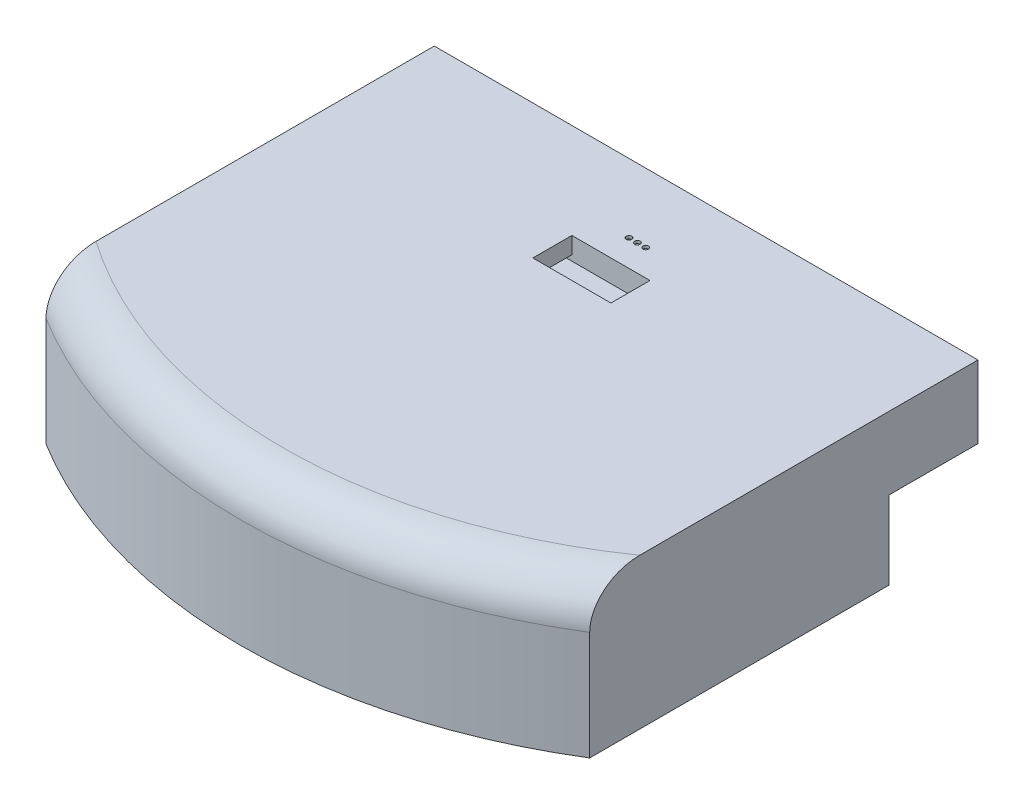
ISO-10303-21;
HEADER;
FILE_DESCRIPTION(('STEP AP214'),'2;1');
FILE_NAME('part.step','',(''),(''),'','','');
FILE_SCHEMA(('AUTOMOTIVE_DESIGN { 1 0 10303 214 1 1 1 1 }'));
ENDSEC;
DATA;
#1=APPLICATION_CONTEXT('core data for automotive mechanical design processes');
#2=APPLICATION_PROTOCOL_DEFINITION('international standard','automotive_design',2000,#1);
#3=PRODUCT_CONTEXT('',#1,'mechanical');
#4=PRODUCT('Part','Part','',(#3));
#5=PRODUCT_RELATED_PRODUCT_CATEGORY('part','',(#4));
#6=PRODUCT_DEFINITION_FORMATION('','',#4);
#7=PRODUCT_DEFINITION_CONTEXT('part definition',#1,'design');
#8=PRODUCT_DEFINITION('design','',#6,#7);
#9=PRODUCT_DEFINITION_SHAPE('','',#8);
#10=(LENGTH_UNIT() NAMED_UNIT(*) SI_UNIT(.MILLI.,.METRE.));
#11=(NAMED_UNIT(*) PLANE_ANGLE_UNIT() SI_UNIT($,.RADIAN.));
#12=(NAMED_UNIT(*) SI_UNIT($,.STERADIAN.) SOLID_ANGLE_UNIT());
#13=UNCERTAINTY_MEASURE_WITH_UNIT(LENGTH_MEASURE(1.E-05),#10,'distance_accuracy_value','');
#14=(GEOMETRIC_REPRESENTATION_CONTEXT(3) GLOBAL_UNCERTAINTY_ASSIGNED_CONTEXT((#13)) GLOBAL_UNIT_ASSIGNED_CONTEXT((#10,
#11,#12)) REPRESENTATION_CONTEXT('',''));
#15=CARTESIAN_POINT('',(0.,0.,0.));
#16=DIRECTION('',(0.,0.,1.));
#17=DIRECTION('',(1.,0.,0.));
#18=AXIS2_PLACEMENT_3D('',#15,#16,#17);
#19=CARTESIAN_POINT('',(14.,46.,66.9255496510706));
#20=DIRECTION('',(1.,0.,0.));
#21=DIRECTION('',(0.,0.,-1.));
#22=AXIS2_PLACEMENT_3D('',#19,#20,#21);
#23=PLANE('',#22);
#24=DIRECTION('',(0.,0.,-1.));
#25=VECTOR('',#24,1.);
#26=CARTESIAN_POINT('',(14.,48.,66.9255496510706));
#27=LINE('',#26,#25);
#28=CARTESIAN_POINT('',(14.,48.,66.9255496510706));
#29=VERTEX_POINT('',#28);
#30=CARTESIAN_POINT('',(14.,48.,52.9255496510706));
#31=VERTEX_POINT('',#30);
#32=EDGE_CURVE('E246',#29,#31,#27,.T.);
#33=ORIENTED_EDGE('',*,*,#32,.F.);
#34=DIRECTION('',(0.,1.,0.));
#35=VECTOR('',#34,1.);
#36=CARTESIAN_POINT('',(14.,46.,66.9255496510706));
#37=LINE('',#36,#35);
#38=CARTESIAN_POINT('',(14.,54.,66.9255496510706));
#39=VERTEX_POINT('',#38);
#40=EDGE_CURVE('E267',#29,#39,#37,.T.);
#41=ORIENTED_EDGE('',*,*,#40,.T.);
#42=DIRECTION('',(0.,0.,-1.));
#43=VECTOR('',#42,1.);
#44=CARTESIAN_POINT('',(14.,54.,66.9255496510706));
#45=LINE('',#44,#43);
#46=CARTESIAN_POINT('',(14.,54.,52.9255496510706));
#47=VERTEX_POINT('',#46);
#48=EDGE_CURVE('E249',#39,#47,#45,.T.);
#49=ORIENTED_EDGE('',*,*,#48,.T.);
#50=DIRECTION('',(0.,1.,0.));
#51=VECTOR('',#50,1.);
#52=CARTESIAN_POINT('',(14.,46.,52.9255496510706));
#53=LINE('',#52,#51);
#54=EDGE_CURVE('E204',#31,#47,#53,.T.);
#55=ORIENTED_EDGE('',*,*,#54,.F.);
#56=EDGE_LOOP('',(#33,#41,#49,#55));
#57=FACE_BOUND('',#56,.T.);
#58=ADVANCED_FACE('F47',(#57),#23,.F.);
#59=CARTESIAN_POINT('',(-14.,46.,66.9255496510706));
#60=DIRECTION('',(-1.,0.,0.));
#61=DIRECTION('',(0.,0.,1.));
#62=AXIS2_PLACEMENT_3D('',#59,#60,#61);
#63=PLANE('',#62);
#64=DIRECTION('',(0.,0.,1.));
#65=VECTOR('',#64,1.);
#66=CARTESIAN_POINT('',(-14.,48.,66.9255496510706));
#67=LINE('',#66,#65);
#68=CARTESIAN_POINT('',(-14.,48.,52.9255496510706));
#69=VERTEX_POINT('',#68);
#70=CARTESIAN_POINT('',(-14.,48.,66.9255496510706));
#71=VERTEX_POINT('',#70);
#72=EDGE_CURVE('E243',#69,#71,#67,.T.);
#73=ORIENTED_EDGE('',*,*,#72,.F.);
#74=DIRECTION('',(0.,1.,0.));
#75=VECTOR('',#74,1.);
#76=CARTESIAN_POINT('',(-14.,46.,52.9255496510706));
#77=LINE('',#76,#75);
#78=CARTESIAN_POINT('',(-14.,54.,52.9255496510706));
#79=VERTEX_POINT('',#78);
#80=EDGE_CURVE('E274',#69,#79,#77,.T.);
#81=ORIENTED_EDGE('',*,*,#80,.T.);
#82=DIRECTION('',(0.,0.,1.));
#83=VECTOR('',#82,1.);
#84=CARTESIAN_POINT('',(-14.,54.,66.9255496510706));
#85=LINE('',#84,#83);
#86=CARTESIAN_POINT('',(-14.,54.,66.9255496510706));
#87=VERTEX_POINT('',#86);
#88=EDGE_CURVE('E260',#79,#87,#85,.T.);
#89=ORIENTED_EDGE('',*,*,#88,.T.);
#90=DIRECTION('',(0.,1.,0.));
#91=VECTOR('',#90,1.);
#92=CARTESIAN_POINT('',(-14.,46.,66.9255496510706));
#93=LINE('',#92,#91);
#94=EDGE_CURVE('E271',#71,#87,#93,.T.);
#95=ORIENTED_EDGE('',*,*,#94,.F.);
#96=EDGE_LOOP('',(#73,#81,#89,#95));
#97=FACE_BOUND('',#96,.T.);
#98=ADVANCED_FACE('F453',(#97),#63,.F.);
#99=CARTESIAN_POINT('',(0.,-5.5,143.24841519261));
#100=DIRECTION('',(0.,0.,1.));
#101=DIRECTION('',(1.,0.,0.));
#102=AXIS2_PLACEMENT_3D('',#99,#100,#101);
#103=PLANE('',#102);
#104=DIRECTION('',(1.,0.,0.));
#105=VECTOR('',#104,1.);
#106=CARTESIAN_POINT('',(6.90000000000001,-2.,143.24841519261));
#107=LINE('',#106,#105);
#108=CARTESIAN_POINT('',(-6.9,-2.,143.24841519261));
#109=VERTEX_POINT('',#108);
#110=CARTESIAN_POINT('',(6.90000000000001,-2.,143.24841519261));
#111=VERTEX_POINT('',#110);
#112=EDGE_CURVE('E299',#109,#111,#107,.T.);
#113=ORIENTED_EDGE('',*,*,#112,.F.);
#114=DIRECTION('',(0.,1.,0.));
#115=VECTOR('',#114,1.);
#116=CARTESIAN_POINT('',(-6.9,-5.5,143.24841519261));
#117=LINE('',#116,#115);
#118=CARTESIAN_POINT('',(-6.9,0.,143.24841519261));
#119=VERTEX_POINT('',#118);
#120=EDGE_CURVE('E355',#109,#119,#117,.T.);
#121=ORIENTED_EDGE('',*,*,#120,.T.);
#122=DIRECTION('',(1.,0.,0.));
#123=VECTOR('',#122,1.);
#124=CARTESIAN_POINT('',(0.,0.,143.24841519261));
#125=LINE('',#124,#123);
#126=CARTESIAN_POINT('',(6.90000000000001,0.,143.24841519261));
#127=VERTEX_POINT('',#126);
#128=EDGE_CURVE('E331',#119,#127,#125,.T.);
#129=ORIENTED_EDGE('',*,*,#128,.T.);
#130=DIRECTION('',(0.,1.,0.));
#131=VECTOR('',#130,1.);
#132=CARTESIAN_POINT('',(6.90000000000001,-5.5,143.24841519261));
#133=LINE('',#132,#131);
#134=EDGE_CURVE('E338',#111,#127,#133,.T.);
#135=ORIENTED_EDGE('',*,*,#134,.F.);
#136=EDGE_LOOP('',(#113,#121,#129,#135));
#137=FACE_BOUND('',#136,.T.);
#138=ADVANCED_FACE('F449',(#137),#103,.F.);
#139=CARTESIAN_POINT('',(0.,39.,0.));
#140=DIRECTION('',(0.,-1.,0.));
#141=DIRECTION('',(0.,0.,-1.));
#142=AXIS2_PLACEMENT_3D('',#139,#140,#141);
#143=TOROIDAL_SURFACE('',#142,170.688415192609,15.);
#144=CARTESIAN_POINT('',(0.,54.,0.));
#145=DIRECTION('',(0.,-1.,0.));
#146=DIRECTION('',(0.,0.,-1.));
#147=AXIS2_PLACEMENT_3D('',#144,#145,#146);
#148=CIRCLE('',#147,170.688415192609);
#149=CARTESIAN_POINT('',(-97.5,54.,140.100981727341));
#150=VERTEX_POINT('',#149);
#151=CARTESIAN_POINT('',(97.5,54.,140.100981727341));
#152=VERTEX_POINT('',#151);
#153=EDGE_CURVE('E422',#150,#152,#148,.F.);
#154=ORIENTED_EDGE('',*,*,#153,.F.);
#155=CARTESIAN_POINT('',(-97.5,39.,158.031444772054));
#156=CARTESIAN_POINT('',(-97.5,39.1879924681215,158.031446223805));
#157=CARTESIAN_POINT('',(-97.5,39.3759597927938,158.027291244968));
#158=CARTESIAN_POINT('',(-97.5,39.751521012494,158.010694447684));
#159=CARTESIAN_POINT('',(-97.5,39.9391149217343,157.998252950918));
#160=CARTESIAN_POINT('',(-97.5,40.500662506004,157.948555923432));
#161=CARTESIAN_POINT('',(-97.5,40.8735948264257,157.898927793558));
#162=CARTESIAN_POINT('',(-97.5,41.612025180334,157.76763075772));
#163=CARTESIAN_POINT('',(-97.5,41.9775485974379,157.686102954915));
#164=CARTESIAN_POINT('',(-97.5,42.7002901273807,157.492053428739));
#165=CARTESIAN_POINT('',(-97.5,43.0575078711313,157.379530330841));
#166=CARTESIAN_POINT('',(-97.5,43.7608507026004,157.125018180973));
#167=CARTESIAN_POINT('',(-97.5,44.1069867227887,156.983059271577));
#168=CARTESIAN_POINT('',(-97.5,44.7864680682248,156.671252449585));
#169=CARTESIAN_POINT('',(-97.5,45.1198124577483,156.501402501504));
#170=CARTESIAN_POINT('',(-97.5,45.7720980307479,156.135544071362));
#171=CARTESIAN_POINT('',(-97.5,46.0910291775804,155.939517725919));
#172=CARTESIAN_POINT('',(-97.5,46.7127416212091,155.523367138975));
#173=CARTESIAN_POINT('',(-97.5,47.0155224342878,155.303242176301));
#174=CARTESIAN_POINT('',(-97.5,47.6191480964551,154.828790244516));
#175=CARTESIAN_POINT('',(-97.5,47.9190582817659,154.573274887887));
#176=CARTESIAN_POINT('',(-97.5,48.4985373928006,154.040167228897));
#177=CARTESIAN_POINT('',(-97.5,48.7781057709707,153.762574332682));
#178=CARTESIAN_POINT('',(-97.5,49.3161513668587,153.187571009551));
#179=CARTESIAN_POINT('',(-97.5,49.5746241711453,152.890156459245));
#180=CARTESIAN_POINT('',(-97.5,50.0698808905563,152.27776869486));
#181=CARTESIAN_POINT('',(-97.5,50.3066621740181,151.962793357706));
#182=CARTESIAN_POINT('',(-97.5,50.7898837648696,151.272076263084));
#183=CARTESIAN_POINT('',(-97.5,51.0330094098401,150.894013361566));
#184=CARTESIAN_POINT('',(-97.5,51.490302858241,150.120776481839));
#185=CARTESIAN_POINT('',(-97.5,51.7044683842049,149.725601161108));
#186=CARTESIAN_POINT('',(-97.5,52.1038178615854,148.920821602338));
#187=CARTESIAN_POINT('',(-97.5,52.2889976367304,148.511215295477));
#188=CARTESIAN_POINT('',(-97.5,52.6305024528652,147.680016425195));
#189=CARTESIAN_POINT('',(-97.5,52.7868172804124,147.258419679791));
#190=CARTESIAN_POINT('',(-97.5,53.0935579300089,146.337116463024));
#191=CARTESIAN_POINT('',(-97.5,53.238999583138,145.835746358503));
#192=CARTESIAN_POINT('',(-97.5,53.4916311543339,144.823470046713));
#193=CARTESIAN_POINT('',(-97.5,53.5988181082987,144.312563103726));
#194=CARTESIAN_POINT('',(-97.5,53.7755053175575,143.283818170813));
#195=CARTESIAN_POINT('',(-97.5,53.8449717482113,142.765974385391));
#196=CARTESIAN_POINT('',(-97.5,53.9465680619031,141.726626109067));
#197=CARTESIAN_POINT('',(-97.5,53.9786947953048,141.205121313088));
#198=CARTESIAN_POINT('',(-97.5,54.0079807535442,140.087841426832));
#199=CARTESIAN_POINT('',(-97.5,53.9995995311413,139.491915036721));
#200=CARTESIAN_POINT('',(-97.5,53.9354343146483,138.30258578409));
#201=CARTESIAN_POINT('',(-97.5,53.8796453125308,137.709183194833));
#202=CARTESIAN_POINT('',(-97.5,53.7212203399147,136.529555524861));
#203=CARTESIAN_POINT('',(-97.5,53.6186547596804,135.943321013694));
#204=CARTESIAN_POINT('',(-97.5,53.3669424243175,134.781000568222));
#205=CARTESIAN_POINT('',(-97.5,53.2177997244401,134.204913755015));
#206=CARTESIAN_POINT('',(-97.5,53.0454814624395,133.635786886149));
#207=B_SPLINE_CURVE_WITH_KNOTS('',3,(#155,#156,#157,#158,#159,#160,#161,#162,#163,#164,#165,
#166,#167,#168,#169,#170,#171,#172,#173,#174,#175,#176,#177,#178,#179,#180,#181,#182,#183,#184,
#185,#186,#187,#188,#189,#190,#191,#192,#193,#194,#195,#196,#197,#198,#199,#200,#201,#202,#203,
#204,#205,#206),.UNSPECIFIED.,.F.,.F.,(4,2,2,2,2,2,2,2,2,2,2,2,2,2,2,2,2,2,2,2,2,2,2,2,2,4),(0.,
0.56388155257655,1.12774121666684,2.25482442288511,3.37697751294988,4.49918037444742,
5.62023971402813,6.74138090481983,7.86329113612908,8.98523495083815,10.1660304347723,
11.3468576912012,12.5279313600774,13.7091481301554,15.0562767012667,16.4035111510162,
17.7509395321961,19.098843771584,20.6633815571553,22.2280405420412,23.7941002761446,
25.3602920991853,27.146296134611,28.9324888620426,30.716002517455,32.49936093398),.UNSPECIFIED.);
#208=CARTESIAN_POINT('',(-97.5,39.,158.031444772055));
#209=VERTEX_POINT('',#208);
#210=EDGE_CURVE('E57',#209,#150,#207,.T.);
#211=ORIENTED_EDGE('',*,*,#210,.F.);
#212=CARTESIAN_POINT('',(0.,39.,0.));
#213=DIRECTION('',(0.,-1.,0.));
#214=DIRECTION('',(0.,0.,-1.));
#215=AXIS2_PLACEMENT_3D('',#212,#213,#214);
#216=CIRCLE('',#215,185.688415192609);
#217=CARTESIAN_POINT('',(97.5,39.,158.031444772055));
#218=VERTEX_POINT('',#217);
#219=EDGE_CURVE('E435',#218,#209,#216,.T.);
#220=ORIENTED_EDGE('',*,*,#219,.F.);
#221=CARTESIAN_POINT('',(97.5,54.,140.100981727341));
#222=CARTESIAN_POINT('',(97.5,53.9999978127173,140.419395035162));
#223=CARTESIAN_POINT('',(97.5,53.993169081125,140.737809575596));
#224=CARTESIAN_POINT('',(97.5,53.9657579954031,141.373950673224));
#225=CARTESIAN_POINT('',(97.5,53.9451797152616,141.691677406248));
#226=CARTESIAN_POINT('',(97.5,53.8901411535707,142.326264202521));
#227=CARTESIAN_POINT('',(97.5,53.8556667786081,142.643123056105));
#228=CARTESIAN_POINT('',(97.5,53.7727217970387,143.275080655269));
#229=CARTESIAN_POINT('',(97.5,53.7242463215606,143.590178749624));
#230=CARTESIAN_POINT('',(97.5,53.5572421683831,144.533964235539));
#231=CARTESIAN_POINT('',(97.5,53.4173114101337,145.159085986999));
#232=CARTESIAN_POINT('',(97.5,53.1641729890058,146.084701539503));
#233=CARTESIAN_POINT('',(97.5,53.0725638203939,146.391288982625));
#234=CARTESIAN_POINT('',(97.5,52.8747865714744,146.999826534385));
#235=CARTESIAN_POINT('',(97.5,52.7686153625946,147.301775630956));
#236=CARTESIAN_POINT('',(97.5,52.4781632733802,148.067466398186));
#237=CARTESIAN_POINT('',(97.5,52.283398607026,148.527283619841));
#238=CARTESIAN_POINT('',(97.5,51.8581426933434,149.429987395168));
#239=CARTESIAN_POINT('',(97.5,51.6276571918076,149.87287665749));
#240=CARTESIAN_POINT('',(97.5,51.13116809652,150.737723499342));
#241=CARTESIAN_POINT('',(97.5,50.8652074726522,151.159705568096));
#242=CARTESIAN_POINT('',(97.5,50.439845722186,151.774211217184));
#243=CARTESIAN_POINT('',(97.5,50.2936505644344,151.975973885233));
#244=CARTESIAN_POINT('',(97.5,49.9924483571192,152.372939835032));
#245=CARTESIAN_POINT('',(97.5,49.8374377622505,152.568140426773));
#246=CARTESIAN_POINT('',(97.5,49.3565744583851,153.146362893207));
#247=CARTESIAN_POINT('',(97.5,49.0173580488775,153.518422669281));
#248=CARTESIAN_POINT('',(97.5,48.3049819875282,154.228488041473));
#249=CARTESIAN_POINT('',(97.5,47.9318287165129,154.56650001419));
#250=CARTESIAN_POINT('',(97.5,47.348411493892,155.044163423255));
#251=CARTESIAN_POINT('',(97.5,47.1500223658122,155.19847143339));
#252=CARTESIAN_POINT('',(97.5,46.7456884045035,155.4967192135));
#253=CARTESIAN_POINT('',(97.5,46.5397456002359,155.640661737364));
#254=CARTESIAN_POINT('',(97.5,45.9110876384819,156.056044032669));
#255=CARTESIAN_POINT('',(97.5,45.4773770662562,156.311174891849));
#256=CARTESIAN_POINT('',(97.5,44.6515622135538,156.738428770564));
#257=CARTESIAN_POINT('',(97.5,44.2629003992993,156.917256826471));
#258=CARTESIAN_POINT('',(97.5,43.4703143643482,157.23721252696));
#259=CARTESIAN_POINT('',(97.5,43.066391520411,157.378343563116));
#260=CARTESIAN_POINT('',(97.5,42.2469777960557,157.6205788753));
#261=CARTESIAN_POINT('',(97.5,41.8314942565042,157.721707957966));
#262=CARTESIAN_POINT('',(97.5,40.9925738574797,157.882365149887));
#263=CARTESIAN_POINT('',(97.5,40.5691380492707,157.941898718731));
#264=CARTESIAN_POINT('',(97.5,39.773385397876,158.013417893851));
#265=CARTESIAN_POINT('',(97.5,39.401522772208,158.030547689708));
#266=CARTESIAN_POINT('',(97.5,38.6577512924865,158.032273049512));
#267=CARTESIAN_POINT('',(97.5,38.2858424450685,158.016871384478));
#268=CARTESIAN_POINT('',(97.5,37.5438547189082,157.953651015224));
#269=CARTESIAN_POINT('',(97.5,37.17378232104,157.905755075916));
#270=CARTESIAN_POINT('',(97.5,36.6229039483057,157.810048397197));
#271=CARTESIAN_POINT('',(97.5,36.4399508269966,157.774160570198));
#272=CARTESIAN_POINT('',(97.5,36.0757611991189,157.694548928273));
#273=CARTESIAN_POINT('',(97.5,35.8945246558472,157.65082528129));
#274=CARTESIAN_POINT('',(97.5,35.7142843869774,157.60324301996));
#275=B_SPLINE_CURVE_WITH_KNOTS('',3,(#221,#222,#223,#224,#225,#226,#227,#228,#229,#230,#231,
#232,#233,#234,#235,#236,#237,#238,#239,#240,#241,#242,#243,#244,#245,#246,#247,#248,#249,#250,
#251,#252,#253,#254,#255,#256,#257,#258,#259,#260,#261,#262,#263,#264,#265,#266,#267,#268,#269,
#270,#271,#272,#273,#274),.UNSPECIFIED.,.F.,.F.,(4,2,2,2,2,2,2,2,2,2,2,2,2,2,2,2,2,2,2,2,2,2,2,
2,2,2,4),(0.,0.95516634555786,1.91004980097456,2.86590414529,3.822091288204,5.74063781054921,
6.70029497898201,7.66015864825133,9.1566578614191,10.652916608011,12.1473791690403,
12.8946520644332,13.6422276456255,15.150382340682,16.6582540556459,17.4119664740376,
18.1654779025648,19.6718596237181,20.9535672640914,22.2351595512213,23.5159558265349,
24.7965839602507,25.9119632977848,27.0272476315288,28.1451921962078,28.704362622939,
29.2635210666734),.UNSPECIFIED.);
#276=EDGE_CURVE('E426',#152,#218,#275,.T.);
#277=ORIENTED_EDGE('',*,*,#276,.F.);
#278=EDGE_LOOP('',(#154,#211,#220,#277));
#279=FACE_BOUND('',#278,.T.);
#280=ADVANCED_FACE('F49',(#279),#143,.T.);
#281=CARTESIAN_POINT('',(0.,54.,0.));
#282=DIRECTION('',(0.,-1.,0.));
#283=DIRECTION('',(0.,0.,-1.));
#284=AXIS2_PLACEMENT_3D('',#281,#282,#283);
#285=CYLINDRICAL_SURFACE('',#284,185.688415192609);
#286=DIRECTION('',(0.,-1.,0.));
#287=VECTOR('',#286,1.);
#288=CARTESIAN_POINT('',(97.5,54.,158.031444772055));
#289=LINE('',#288,#287);
#290=CARTESIAN_POINT('',(97.5,0.,158.031444772055));
#291=VERTEX_POINT('',#290);
#292=EDGE_CURVE('E419',#218,#291,#289,.T.);
#293=ORIENTED_EDGE('',*,*,#292,.F.);
#294=ORIENTED_EDGE('',*,*,#219,.T.);
#295=DIRECTION('',(0.,-1.,0.));
#296=VECTOR('',#295,1.);
#297=CARTESIAN_POINT('',(-97.5,54.,158.031444772055));
#298=LINE('',#297,#296);
#299=CARTESIAN_POINT('',(-97.5,0.,158.031444772055));
#300=VERTEX_POINT('',#299);
#301=EDGE_CURVE('E398',#209,#300,#298,.T.);
#302=ORIENTED_EDGE('',*,*,#301,.T.);
#303=CARTESIAN_POINT('',(0.,0.,0.));
#304=DIRECTION('',(0.,1.,0.));
#305=DIRECTION('',(0.,0.,-1.));
#306=AXIS2_PLACEMENT_3D('',#303,#304,#305);
#307=CIRCLE('',#306,185.688415192609);
#308=EDGE_CURVE('E386',#300,#291,#307,.T.);
#309=ORIENTED_EDGE('',*,*,#308,.T.);
#310=EDGE_LOOP('',(#293,#294,#302,#309));
#311=FACE_BOUND('',#310,.T.);
#312=ADVANCED_FACE('F441',(#311),#285,.T.);
#313=CARTESIAN_POINT('',(97.5,54.,158.031444772055));
#314=DIRECTION('',(-1.,0.,0.));
#315=DIRECTION('',(0.,0.,1.));
#316=AXIS2_PLACEMENT_3D('',#313,#314,#315);
#317=PLANE('',#316);
#318=DIRECTION('',(0.,1.,0.));
#319=VECTOR('',#318,1.);
#320=CARTESIAN_POINT('',(97.5,54.,50.7714447720546));
#321=LINE('',#320,#319);
#322=CARTESIAN_POINT('',(97.5,0.,50.7714447720546));
#323=VERTEX_POINT('',#322);
#324=CARTESIAN_POINT('',(97.5000000000001,28.,50.7714447720546));
#325=VERTEX_POINT('',#324);
#326=EDGE_CURVE('E376',#323,#325,#321,.T.);
#327=ORIENTED_EDGE('',*,*,#326,.T.);
#328=DIRECTION('',(0.,0.,-1.));
#329=VECTOR('',#328,1.);
#330=CARTESIAN_POINT('',(97.5,28.,158.031444772055));
#331=LINE('',#330,#329);
#332=CARTESIAN_POINT('',(97.5000000000001,28.,18.7714447720545));
#333=VERTEX_POINT('',#332);
#334=EDGE_CURVE('E382',#325,#333,#331,.T.);
#335=ORIENTED_EDGE('',*,*,#334,.T.);
#336=DIRECTION('',(0.,-1.,0.));
#337=VECTOR('',#336,1.);
#338=CARTESIAN_POINT('',(97.5,54.,18.7714447720546));
#339=LINE('',#338,#337);
#340=CARTESIAN_POINT('',(97.5,54.,18.7714447720546));
#341=VERTEX_POINT('',#340);
#342=EDGE_CURVE('E415',#341,#333,#339,.T.);
#343=ORIENTED_EDGE('',*,*,#342,.F.);
#344=DIRECTION('',(0.,0.,-1.));
#345=VECTOR('',#344,1.);
#346=CARTESIAN_POINT('',(97.5,54.,158.031444772055));
#347=LINE('',#346,#345);
#348=EDGE_CURVE('E387',#152,#341,#347,.T.);
#349=ORIENTED_EDGE('',*,*,#348,.F.);
#350=ORIENTED_EDGE('',*,*,#276,.T.);
#351=ORIENTED_EDGE('',*,*,#292,.T.);
#352=DIRECTION('',(0.,0.,-1.));
#353=VECTOR('',#352,1.);
#354=CARTESIAN_POINT('',(97.5,0.,158.031444772055));
#355=LINE('',#354,#353);
#356=EDGE_CURVE('E402',#291,#323,#355,.T.);
#357=ORIENTED_EDGE('',*,*,#356,.T.);
#358=EDGE_LOOP('',(#327,#335,#343,#349,#350,#351,#357));
#359=FACE_BOUND('',#358,.T.);
#360=ADVANCED_FACE('F436',(#359),#317,.F.);
#361=CARTESIAN_POINT('',(-97.5,54.,18.7714447720546));
#362=DIRECTION('',(0.,0.,1.));
#363=DIRECTION('',(1.,0.,0.));
#364=AXIS2_PLACEMENT_3D('',#361,#362,#363);
#365=PLANE('',#364);
#366=ORIENTED_EDGE('',*,*,#342,.T.);
#367=DIRECTION('',(-1.,0.,0.));
#368=VECTOR('',#367,1.);
#369=CARTESIAN_POINT('',(347.5,28.,18.7714447720545));
#370=LINE('',#369,#368);
#371=CARTESIAN_POINT('',(-97.5,28.,18.7714447720546));
#372=VERTEX_POINT('',#371);
#373=EDGE_CURVE('E372',#333,#372,#370,.T.);
#374=ORIENTED_EDGE('',*,*,#373,.T.);
#375=DIRECTION('',(0.,-1.,0.));
#376=VECTOR('',#375,1.);
#377=CARTESIAN_POINT('',(-97.5,54.,18.7714447720546));
#378=LINE('',#377,#376);
#379=CARTESIAN_POINT('',(-97.5,54.,18.7714447720546));
#380=VERTEX_POINT('',#379);
#381=EDGE_CURVE('E411',#380,#372,#378,.T.);
#382=ORIENTED_EDGE('',*,*,#381,.F.);
#383=DIRECTION('',(-1.,0.,0.));
#384=VECTOR('',#383,1.);
#385=CARTESIAN_POINT('',(-97.5,54.,18.7714447720546));
#386=LINE('',#385,#384);
#387=EDGE_CURVE('E390',#341,#380,#386,.T.);
#388=ORIENTED_EDGE('',*,*,#387,.F.);
#389=EDGE_LOOP('',(#366,#374,#382,#388));
#390=FACE_BOUND('',#389,.T.);
#391=ADVANCED_FACE('F440',(#390),#365,.F.);
#392=CARTESIAN_POINT('',(-97.5,54.,18.7714447720546));
#393=DIRECTION('',(1.,0.,0.));
#394=DIRECTION('',(0.,0.,-1.));
#395=AXIS2_PLACEMENT_3D('',#392,#393,#394);
#396=PLANE('',#395);
#397=ORIENTED_EDGE('',*,*,#381,.T.);
#398=DIRECTION('',(0.,0.,-1.));
#399=VECTOR('',#398,1.);
#400=CARTESIAN_POINT('',(-97.5,28.,18.7714447720546));
#401=LINE('',#400,#399);
#402=CARTESIAN_POINT('',(-97.5,28.,50.7714447720546));
#403=VERTEX_POINT('',#402);
#404=EDGE_CURVE('E368',#403,#372,#401,.T.);
#405=ORIENTED_EDGE('',*,*,#404,.F.);
#406=DIRECTION('',(0.,1.,0.));
#407=VECTOR('',#406,1.);
#408=CARTESIAN_POINT('',(-97.5,0.,50.7714447720546));
#409=LINE('',#408,#407);
#410=CARTESIAN_POINT('',(-97.5,0.,50.7714447720546));
#411=VERTEX_POINT('',#410);
#412=EDGE_CURVE('E364',#411,#403,#409,.T.);
#413=ORIENTED_EDGE('',*,*,#412,.F.);
#414=DIRECTION('',(0.,0.,1.));
#415=VECTOR('',#414,1.);
#416=CARTESIAN_POINT('',(-97.5,0.,18.7714447720546));
#417=LINE('',#416,#415);
#418=EDGE_CURVE('E391',#411,#300,#417,.T.);
#419=ORIENTED_EDGE('',*,*,#418,.T.);
#420=ORIENTED_EDGE('',*,*,#301,.F.);
#421=ORIENTED_EDGE('',*,*,#210,.T.);
#422=DIRECTION('',(0.,0.,1.));
#423=VECTOR('',#422,1.);
#424=CARTESIAN_POINT('',(-97.5,54.,18.7714447720546));
#425=LINE('',#424,#423);
#426=EDGE_CURVE('E394',#380,#150,#425,.T.);
#427=ORIENTED_EDGE('',*,*,#426,.F.);
#428=EDGE_LOOP('',(#397,#405,#413,#419,#420,#421,#427));
#429=FACE_BOUND('',#428,.T.);
#430=ADVANCED_FACE('F527',(#429),#396,.F.);
#431=CARTESIAN_POINT('',(0.,54.,0.));
#432=DIRECTION('',(0.,-1.,0.));
#433=DIRECTION('',(0.,0.,-1.));
#434=AXIS2_PLACEMENT_3D('',#431,#432,#433);
#435=PLANE('',#434);
#436=DIRECTION('',(-1.,0.,0.));
#437=VECTOR('',#436,1.);
#438=CARTESIAN_POINT('',(-14.,54.,52.9255496510706));
#439=LINE('',#438,#437);
#440=EDGE_CURVE('E256',#47,#79,#439,.T.);
#441=ORIENTED_EDGE('',*,*,#440,.F.);
#442=ORIENTED_EDGE('',*,*,#48,.F.);
#443=DIRECTION('',(1.,0.,0.));
#444=VECTOR('',#443,1.);
#445=CARTESIAN_POINT('',(-14.,54.,66.9255496510706));
#446=LINE('',#445,#444);
#447=EDGE_CURVE('E251',#87,#39,#446,.T.);
#448=ORIENTED_EDGE('',*,*,#447,.F.);
#449=ORIENTED_EDGE('',*,*,#88,.F.);
#450=EDGE_LOOP('',(#441,#442,#448,#449));
#451=FACE_BOUND('',#450,.T.);
#452=CARTESIAN_POINT('',(-3.,54.,43.4388276887888));
#453=DIRECTION('',(0.,1.,0.));
#454=DIRECTION('',(0.,0.,1.));
#455=AXIS2_PLACEMENT_3D('',#452,#453,#454);
#456=CIRCLE('',#455,1.);
#457=CARTESIAN_POINT('',(-3.,54.,44.4388276887888));
#458=VERTEX_POINT('',#457);
#459=EDGE_CURVE('E288',#458,#458,#456,.T.);
#460=ORIENTED_EDGE('',*,*,#459,.F.);
#461=EDGE_LOOP('',(#460));
#462=FACE_BOUND('',#461,.T.);
#463=CARTESIAN_POINT('',(3.,54.,43.4388276887887));
#464=DIRECTION('',(0.,1.,0.));
#465=DIRECTION('',(0.,0.,1.));
#466=AXIS2_PLACEMENT_3D('',#463,#464,#465);
#467=CIRCLE('',#466,1.);
#468=CARTESIAN_POINT('',(3.,54.,44.4388276887887));
#469=VERTEX_POINT('',#468);
#470=EDGE_CURVE('E279',#469,#469,#467,.T.);
#471=ORIENTED_EDGE('',*,*,#470,.F.);
#472=EDGE_LOOP('',(#471));
#473=FACE_BOUND('',#472,.T.);
#474=CARTESIAN_POINT('',(0.,54.,43.4388276887887));
#475=DIRECTION('',(0.,1.,0.));
#476=DIRECTION('',(0.,0.,1.));
#477=AXIS2_PLACEMENT_3D('',#474,#475,#476);
#478=CIRCLE('',#477,1.);
#479=CARTESIAN_POINT('',(0.,54.,44.4388276887887));
#480=VERTEX_POINT('',#479);
#481=EDGE_CURVE('E283',#480,#480,#478,.T.);
#482=ORIENTED_EDGE('',*,*,#481,.F.);
#483=EDGE_LOOP('',(#482));
#484=FACE_BOUND('',#483,.T.);
#485=ORIENTED_EDGE('',*,*,#426,.T.);
#486=ORIENTED_EDGE('',*,*,#153,.T.);
#487=ORIENTED_EDGE('',*,*,#348,.T.);
#488=ORIENTED_EDGE('',*,*,#387,.T.);
#489=EDGE_LOOP('',(#485,#486,#487,#488));
#490=FACE_BOUND('',#489,.T.);
#491=ADVANCED_FACE('F525',(#451,#462,#473,#484,#490),#435,.F.);
#492=CARTESIAN_POINT('',(0.,0.,0.));
#493=DIRECTION('',(0.,-1.,0.));
#494=DIRECTION('',(0.,0.,-1.));
#495=AXIS2_PLACEMENT_3D('',#492,#493,#494);
#496=PLANE('',#495);
#497=DIRECTION('',(0.,0.,-1.));
#498=VECTOR('',#497,1.);
#499=CARTESIAN_POINT('',(6.90000000000002,0.,0.));
#500=LINE('',#499,#498);
#501=CARTESIAN_POINT('',(6.9,0.,159.748415192609));
#502=VERTEX_POINT('',#501);
#503=EDGE_CURVE('E326',#502,#127,#500,.T.);
#504=ORIENTED_EDGE('',*,*,#503,.T.);
#505=ORIENTED_EDGE('',*,*,#128,.F.);
#506=DIRECTION('',(0.,0.,-1.));
#507=VECTOR('',#506,1.);
#508=CARTESIAN_POINT('',(-6.89999999999998,0.,0.));
#509=LINE('',#508,#507);
#510=CARTESIAN_POINT('',(-6.9,0.,159.748415192609));
#511=VERTEX_POINT('',#510);
#512=EDGE_CURVE('E346',#511,#119,#509,.T.);
#513=ORIENTED_EDGE('',*,*,#512,.F.);
#514=DIRECTION('',(1.,0.,0.));
#515=VECTOR('',#514,1.);
#516=CARTESIAN_POINT('',(0.,0.,159.748415192609));
#517=LINE('',#516,#515);
#518=EDGE_CURVE('E342',#511,#502,#517,.T.);
#519=ORIENTED_EDGE('',*,*,#518,.T.);
#520=EDGE_LOOP('',(#504,#505,#513,#519));
#521=FACE_BOUND('',#520,.T.);
#522=DIRECTION('',(-1.,0.,0.));
#523=VECTOR('',#522,1.);
#524=CARTESIAN_POINT('',(0.,0.,50.7714447720546));
#525=LINE('',#524,#523);
#526=EDGE_CURVE('E11',#323,#411,#525,.T.);
#527=ORIENTED_EDGE('',*,*,#526,.F.);
#528=ORIENTED_EDGE('',*,*,#356,.F.);
#529=ORIENTED_EDGE('',*,*,#308,.F.);
#530=ORIENTED_EDGE('',*,*,#418,.F.);
#531=EDGE_LOOP('',(#527,#528,#529,#530));
#532=FACE_BOUND('',#531,.T.);
#533=ADVANCED_FACE('F520',(#521,#532),#496,.T.);
#534=CARTESIAN_POINT('',(347.5,28.,18.7714447720545));
#535=DIRECTION('',(0.,1.,0.));
#536=DIRECTION('',(0.,0.,1.));
#537=AXIS2_PLACEMENT_3D('',#534,#535,#536);
#538=PLANE('',#537);
#539=DIRECTION('',(-1.,0.,0.));
#540=VECTOR('',#539,1.);
#541=CARTESIAN_POINT('',(347.5,28.,50.7714447720545));
#542=LINE('',#541,#540);
#543=EDGE_CURVE('E371',#325,#403,#542,.T.);
#544=ORIENTED_EDGE('',*,*,#543,.T.);
#545=ORIENTED_EDGE('',*,*,#404,.T.);
#546=ORIENTED_EDGE('',*,*,#373,.F.);
#547=ORIENTED_EDGE('',*,*,#334,.F.);
#548=EDGE_LOOP('',(#544,#545,#546,#547));
#549=FACE_BOUND('',#548,.T.);
#550=ADVANCED_FACE('F517',(#549),#538,.F.);
#551=CARTESIAN_POINT('',(347.5,0.,50.7714447720545));
#552=DIRECTION('',(0.,0.,1.));
#553=DIRECTION('',(1.,0.,0.));
#554=AXIS2_PLACEMENT_3D('',#551,#552,#553);
#555=PLANE('',#554);
#556=ORIENTED_EDGE('',*,*,#526,.T.);
#557=ORIENTED_EDGE('',*,*,#412,.T.);
#558=ORIENTED_EDGE('',*,*,#543,.F.);
#559=ORIENTED_EDGE('',*,*,#326,.F.);
#560=EDGE_LOOP('',(#556,#557,#558,#559));
#561=FACE_BOUND('',#560,.T.);
#562=ADVANCED_FACE('F515',(#561),#555,.F.);
#563=CARTESIAN_POINT('',(6.90000000000002,-5.5,0.));
#564=DIRECTION('',(1.,0.,0.));
#565=DIRECTION('',(0.,0.,-1.));
#566=AXIS2_PLACEMENT_3D('',#563,#564,#565);
#567=PLANE('',#566);
#568=ORIENTED_EDGE('',*,*,#503,.F.);
#569=DIRECTION('',(0.,1.,0.));
#570=VECTOR('',#569,1.);
#571=CARTESIAN_POINT('',(6.9,-5.5,159.748415192609));
#572=LINE('',#571,#570);
#573=CARTESIAN_POINT('',(6.9,-5.5,159.748415192609));
#574=VERTEX_POINT('',#573);
#575=EDGE_CURVE('E361',#574,#502,#572,.T.);
#576=ORIENTED_EDGE('',*,*,#575,.F.);
#577=DIRECTION('',(0.,0.,-1.));
#578=VECTOR('',#577,1.);
#579=CARTESIAN_POINT('',(6.90000000000002,-5.5,0.));
#580=LINE('',#579,#578);
#581=CARTESIAN_POINT('',(6.90000000000001,-5.5,139.248415192609));
#582=VERTEX_POINT('',#581);
#583=EDGE_CURVE('E327',#574,#582,#580,.T.);
#584=ORIENTED_EDGE('',*,*,#583,.T.);
#585=DIRECTION('',(0.,-1.,0.));
#586=VECTOR('',#585,1.);
#587=CARTESIAN_POINT('',(6.90000000000001,-5.5,139.248415192609));
#588=LINE('',#587,#586);
#589=CARTESIAN_POINT('',(6.90000000000001,-2.,139.248415192609));
#590=VERTEX_POINT('',#589);
#591=EDGE_CURVE('E303',#590,#582,#588,.T.);
#592=ORIENTED_EDGE('',*,*,#591,.F.);
#593=DIRECTION('',(0.,0.,1.));
#594=VECTOR('',#593,1.);
#595=CARTESIAN_POINT('',(6.90000000000001,-2.,139.248415192609));
#596=LINE('',#595,#594);
#597=EDGE_CURVE('E317',#590,#111,#596,.T.);
#598=ORIENTED_EDGE('',*,*,#597,.T.);
#599=ORIENTED_EDGE('',*,*,#134,.T.);
#600=EDGE_LOOP('',(#568,#576,#584,#592,#598,#599));
#601=FACE_BOUND('',#600,.T.);
#602=ADVANCED_FACE('F511',(#601),#567,.T.);
#603=CARTESIAN_POINT('',(0.,-5.5,159.748415192609));
#604=DIRECTION('',(0.,0.,1.));
#605=DIRECTION('',(1.,0.,0.));
#606=AXIS2_PLACEMENT_3D('',#603,#604,#605);
#607=PLANE('',#606);
#608=ORIENTED_EDGE('',*,*,#518,.F.);
#609=DIRECTION('',(0.,1.,0.));
#610=VECTOR('',#609,1.);
#611=CARTESIAN_POINT('',(-6.9,-5.5,159.748415192609));
#612=LINE('',#611,#610);
#613=CARTESIAN_POINT('',(-6.9,-5.5,159.748415192609));
#614=VERTEX_POINT('',#613);
#615=EDGE_CURVE('E358',#614,#511,#612,.T.);
#616=ORIENTED_EDGE('',*,*,#615,.F.);
#617=DIRECTION('',(1.,0.,0.));
#618=VECTOR('',#617,1.);
#619=CARTESIAN_POINT('',(0.,-5.5,159.748415192609));
#620=LINE('',#619,#618);
#621=EDGE_CURVE('E330',#614,#574,#620,.T.);
#622=ORIENTED_EDGE('',*,*,#621,.T.);
#623=ORIENTED_EDGE('',*,*,#575,.T.);
#624=EDGE_LOOP('',(#608,#616,#622,#623));
#625=FACE_BOUND('',#624,.T.);
#626=ADVANCED_FACE('F507',(#625),#607,.T.);
#627=CARTESIAN_POINT('',(-6.89999999999998,-5.5,0.));
#628=DIRECTION('',(1.,0.,0.));
#629=DIRECTION('',(0.,0.,-1.));
#630=AXIS2_PLACEMENT_3D('',#627,#628,#629);
#631=PLANE('',#630);
#632=ORIENTED_EDGE('',*,*,#512,.T.);
#633=ORIENTED_EDGE('',*,*,#120,.F.);
#634=DIRECTION('',(0.,0.,1.));
#635=VECTOR('',#634,1.);
#636=CARTESIAN_POINT('',(-6.9,-2.,139.248415192609));
#637=LINE('',#636,#635);
#638=CARTESIAN_POINT('',(-6.9,-2.,139.248415192609));
#639=VERTEX_POINT('',#638);
#640=EDGE_CURVE('E323',#639,#109,#637,.T.);
#641=ORIENTED_EDGE('',*,*,#640,.F.);
#642=DIRECTION('',(0.,1.,0.));
#643=VECTOR('',#642,1.);
#644=CARTESIAN_POINT('',(-6.9,-5.5,139.248415192609));
#645=LINE('',#644,#643);
#646=CARTESIAN_POINT('',(-6.9,-5.5,139.248415192609));
#647=VERTEX_POINT('',#646);
#648=EDGE_CURVE('E311',#647,#639,#645,.T.);
#649=ORIENTED_EDGE('',*,*,#648,.F.);
#650=DIRECTION('',(0.,0.,-1.));
#651=VECTOR('',#650,1.);
#652=CARTESIAN_POINT('',(-6.89999999999998,-5.5,0.));
#653=LINE('',#652,#651);
#654=EDGE_CURVE('E335',#614,#647,#653,.T.);
#655=ORIENTED_EDGE('',*,*,#654,.F.);
#656=ORIENTED_EDGE('',*,*,#615,.T.);
#657=EDGE_LOOP('',(#632,#633,#641,#649,#655,#656));
#658=FACE_BOUND('',#657,.T.);
#659=ADVANCED_FACE('F500',(#658),#631,.F.);
#660=CARTESIAN_POINT('',(0.,-5.5,0.));
#661=DIRECTION('',(0.,-1.,0.));
#662=DIRECTION('',(0.,0.,-1.));
#663=AXIS2_PLACEMENT_3D('',#660,#661,#662);
#664=PLANE('',#663);
#665=ORIENTED_EDGE('',*,*,#583,.F.);
#666=ORIENTED_EDGE('',*,*,#621,.F.);
#667=ORIENTED_EDGE('',*,*,#654,.T.);
#668=DIRECTION('',(-1.,0.,0.));
#669=VECTOR('',#668,1.);
#670=CARTESIAN_POINT('',(6.90000000000001,-5.5,139.248415192609));
#671=LINE('',#670,#669);
#672=EDGE_CURVE('E307',#582,#647,#671,.T.);
#673=ORIENTED_EDGE('',*,*,#672,.F.);
#674=EDGE_LOOP('',(#665,#666,#667,#673));
#675=FACE_BOUND('',#674,.T.);
#676=ADVANCED_FACE('F496',(#675),#664,.T.);
#677=CARTESIAN_POINT('',(6.90000000000001,-2.,139.248415192609));
#678=DIRECTION('',(0.,-1.,0.));
#679=DIRECTION('',(0.,0.,-1.));
#680=AXIS2_PLACEMENT_3D('',#677,#678,#679);
#681=PLANE('',#680);
#682=ORIENTED_EDGE('',*,*,#112,.T.);
#683=ORIENTED_EDGE('',*,*,#597,.F.);
#684=DIRECTION('',(1.,0.,0.));
#685=VECTOR('',#684,1.);
#686=CARTESIAN_POINT('',(6.90000000000001,-2.,139.248415192609));
#687=LINE('',#686,#685);
#688=EDGE_CURVE('E314',#639,#590,#687,.T.);
#689=ORIENTED_EDGE('',*,*,#688,.F.);
#690=ORIENTED_EDGE('',*,*,#640,.T.);
#691=EDGE_LOOP('',(#682,#683,#689,#690));
#692=FACE_BOUND('',#691,.T.);
#693=ADVANCED_FACE('F492',(#692),#681,.F.);
#694=CARTESIAN_POINT('',(0.,0.,139.248415192609));
#695=DIRECTION('',(0.,0.,1.));
#696=DIRECTION('',(1.,0.,0.));
#697=AXIS2_PLACEMENT_3D('',#694,#695,#696);
#698=PLANE('',#697);
#699=ORIENTED_EDGE('',*,*,#591,.T.);
#700=ORIENTED_EDGE('',*,*,#672,.T.);
#701=ORIENTED_EDGE('',*,*,#648,.T.);
#702=ORIENTED_EDGE('',*,*,#688,.T.);
#703=EDGE_LOOP('',(#699,#700,#701,#702));
#704=FACE_BOUND('',#703,.T.);
#705=ADVANCED_FACE('F488',(#704),#698,.F.);
#706=CARTESIAN_POINT('',(0.,53.,43.4388276887887));
#707=DIRECTION('',(0.,1.,0.));
#708=DIRECTION('',(0.,0.,1.));
#709=AXIS2_PLACEMENT_3D('',#706,#707,#708);
#710=CYLINDRICAL_SURFACE('',#709,1.);
#711=CARTESIAN_POINT('',(0.,53.,43.4388276887887));
#712=DIRECTION('',(0.,1.,0.));
#713=DIRECTION('',(0.,0.,1.));
#714=AXIS2_PLACEMENT_3D('',#711,#712,#713);
#715=CIRCLE('',#714,1.);
#716=CARTESIAN_POINT('',(0.,53.,44.4388276887887));
#717=VERTEX_POINT('',#716);
#718=EDGE_CURVE('E295',#717,#717,#715,.T.);
#719=ORIENTED_EDGE('',*,*,#718,.F.);
#720=EDGE_LOOP('',(#719));
#721=FACE_BOUND('',#720,.T.);
#722=ORIENTED_EDGE('',*,*,#481,.T.);
#723=EDGE_LOOP('',(#722));
#724=FACE_BOUND('',#723,.T.);
#725=ADVANCED_FACE('F484',(#721,#724),#710,.F.);
#726=CARTESIAN_POINT('',(0.,53.,43.4388276887887));
#727=DIRECTION('',(0.,1.,0.));
#728=DIRECTION('',(0.,0.,1.));
#729=AXIS2_PLACEMENT_3D('',#726,#727,#728);
#730=PLANE('',#729);
#731=ORIENTED_EDGE('',*,*,#718,.T.);
#732=EDGE_LOOP('',(#731));
#733=FACE_BOUND('',#732,.T.);
#734=ADVANCED_FACE('F469',(#733),#730,.T.);
#735=CARTESIAN_POINT('',(3.,53.,43.4388276887887));
#736=DIRECTION('',(0.,1.,0.));
#737=DIRECTION('',(0.,0.,1.));
#738=AXIS2_PLACEMENT_3D('',#735,#736,#737);
#739=CYLINDRICAL_SURFACE('',#738,1.);
#740=CARTESIAN_POINT('',(3.,53.,43.4388276887887));
#741=DIRECTION('',(0.,1.,0.));
#742=DIRECTION('',(0.,0.,1.));
#743=AXIS2_PLACEMENT_3D('',#740,#741,#742);
#744=CIRCLE('',#743,1.);
#745=CARTESIAN_POINT('',(3.,53.,44.4388276887887));
#746=VERTEX_POINT('',#745);
#747=EDGE_CURVE('E284',#746,#746,#744,.T.);
#748=ORIENTED_EDGE('',*,*,#747,.F.);
#749=EDGE_LOOP('',(#748));
#750=FACE_BOUND('',#749,.T.);
#751=ORIENTED_EDGE('',*,*,#470,.T.);
#752=EDGE_LOOP('',(#751));
#753=FACE_BOUND('',#752,.T.);
#754=ADVANCED_FACE('F465',(#750,#753),#739,.F.);
#755=CARTESIAN_POINT('',(3.,53.,43.4388276887887));
#756=DIRECTION('',(0.,1.,0.));
#757=DIRECTION('',(0.,0.,1.));
#758=AXIS2_PLACEMENT_3D('',#755,#756,#757);
#759=PLANE('',#758);
#760=ORIENTED_EDGE('',*,*,#747,.T.);
#761=EDGE_LOOP('',(#760));
#762=FACE_BOUND('',#761,.T.);
#763=ADVANCED_FACE('F468',(#762),#759,.T.);
#764=CARTESIAN_POINT('',(-3.,53.,43.4388276887888));
#765=DIRECTION('',(0.,1.,0.));
#766=DIRECTION('',(0.,0.,1.));
#767=AXIS2_PLACEMENT_3D('',#764,#765,#766);
#768=CYLINDRICAL_SURFACE('',#767,1.);
#769=CARTESIAN_POINT('',(-3.,53.,43.4388276887888));
#770=DIRECTION('',(0.,1.,0.));
#771=DIRECTION('',(0.,0.,1.));
#772=AXIS2_PLACEMENT_3D('',#769,#770,#771);
#773=CIRCLE('',#772,1.);
#774=CARTESIAN_POINT('',(-3.,53.,44.4388276887888));
#775=VERTEX_POINT('',#774);
#776=EDGE_CURVE('E270',#775,#775,#773,.T.);
#777=ORIENTED_EDGE('',*,*,#776,.F.);
#778=EDGE_LOOP('',(#777));
#779=FACE_BOUND('',#778,.T.);
#780=ORIENTED_EDGE('',*,*,#459,.T.);
#781=EDGE_LOOP('',(#780));
#782=FACE_BOUND('',#781,.T.);
#783=ADVANCED_FACE('F473',(#779,#782),#768,.F.);
#784=CARTESIAN_POINT('',(-3.,53.,43.4388276887888));
#785=DIRECTION('',(0.,1.,0.));
#786=DIRECTION('',(0.,0.,1.));
#787=AXIS2_PLACEMENT_3D('',#784,#785,#786);
#788=PLANE('',#787);
#789=ORIENTED_EDGE('',*,*,#776,.T.);
#790=EDGE_LOOP('',(#789));
#791=FACE_BOUND('',#790,.T.);
#792=ADVANCED_FACE('F477',(#791),#788,.T.);
#793=CARTESIAN_POINT('',(-14.,46.,66.9255496510706));
#794=DIRECTION('',(0.,0.,1.));
#795=DIRECTION('',(1.,0.,0.));
#796=AXIS2_PLACEMENT_3D('',#793,#794,#795);
#797=PLANE('',#796);
#798=DIRECTION('',(1.,0.,0.));
#799=VECTOR('',#798,1.);
#800=CARTESIAN_POINT('',(-14.,46.,66.9255496510706));
#801=LINE('',#800,#799);
#802=CARTESIAN_POINT('',(-17.,46.,66.9255496510706));
#803=VERTEX_POINT('',#802);
#804=CARTESIAN_POINT('',(16.,46.,66.9255496510706));
#805=VERTEX_POINT('',#804);
#806=EDGE_CURVE('E191',#803,#805,#801,.T.);
#807=ORIENTED_EDGE('',*,*,#806,.F.);
#808=DIRECTION('',(0.,-1.,0.));
#809=VECTOR('',#808,1.);
#810=CARTESIAN_POINT('',(-17.,46.,66.9255496510706));
#811=LINE('',#810,#809);
#812=CARTESIAN_POINT('',(-17.,48.,66.9255496510706));
#813=VERTEX_POINT('',#812);
#814=EDGE_CURVE('E196',#813,#803,#811,.T.);
#815=ORIENTED_EDGE('',*,*,#814,.F.);
#816=DIRECTION('',(-1.,0.,0.));
#817=VECTOR('',#816,1.);
#818=CARTESIAN_POINT('',(16.,48.,66.9255496510706));
#819=LINE('',#818,#817);
#820=EDGE_CURVE('E236',#71,#813,#819,.T.);
#821=ORIENTED_EDGE('',*,*,#820,.F.);
#822=ORIENTED_EDGE('',*,*,#94,.T.);
#823=ORIENTED_EDGE('',*,*,#447,.T.);
#824=ORIENTED_EDGE('',*,*,#40,.F.);
#825=CARTESIAN_POINT('',(16.,48.,66.9255496510706));
#826=VERTEX_POINT('',#825);
#827=EDGE_CURVE('E64',#826,#29,#819,.T.);
#828=ORIENTED_EDGE('',*,*,#827,.F.);
#829=DIRECTION('',(0.,-1.,0.));
#830=VECTOR('',#829,1.);
#831=CARTESIAN_POINT('',(16.,46.,66.9255496510706));
#832=LINE('',#831,#830);
#833=EDGE_CURVE('E199',#826,#805,#832,.T.);
#834=ORIENTED_EDGE('',*,*,#833,.T.);
#835=EDGE_LOOP('',(#807,#815,#821,#822,#823,#824,#828,#834));
#836=FACE_BOUND('',#835,.T.);
#837=ADVANCED_FACE('F193',(#836),#797,.F.);
#838=CARTESIAN_POINT('',(-14.,46.,52.9255496510706));
#839=DIRECTION('',(0.,0.,-1.));
#840=DIRECTION('',(-1.,0.,0.));
#841=AXIS2_PLACEMENT_3D('',#838,#839,#840);
#842=PLANE('',#841);
#843=DIRECTION('',(-1.,0.,0.));
#844=VECTOR('',#843,1.);
#845=CARTESIAN_POINT('',(-14.,46.,52.9255496510706));
#846=LINE('',#845,#844);
#847=CARTESIAN_POINT('',(16.,46.,52.9255496510706));
#848=VERTEX_POINT('',#847);
#849=CARTESIAN_POINT('',(-17.,46.,52.9255496510706));
#850=VERTEX_POINT('',#849);
#851=EDGE_CURVE('E205',#848,#850,#846,.T.);
#852=ORIENTED_EDGE('',*,*,#851,.F.);
#853=DIRECTION('',(0.,1.,0.));
#854=VECTOR('',#853,1.);
#855=CARTESIAN_POINT('',(16.,46.,52.9255496510706));
#856=LINE('',#855,#854);
#857=CARTESIAN_POINT('',(16.,48.,52.9255496510706));
#858=VERTEX_POINT('',#857);
#859=EDGE_CURVE('E230',#848,#858,#856,.T.);
#860=ORIENTED_EDGE('',*,*,#859,.T.);
#861=DIRECTION('',(-1.,0.,0.));
#862=VECTOR('',#861,1.);
#863=CARTESIAN_POINT('',(16.,48.,52.9255496510706));
#864=LINE('',#863,#862);
#865=EDGE_CURVE('E239',#858,#31,#864,.T.);
#866=ORIENTED_EDGE('',*,*,#865,.T.);
#867=ORIENTED_EDGE('',*,*,#54,.T.);
#868=ORIENTED_EDGE('',*,*,#440,.T.);
#869=ORIENTED_EDGE('',*,*,#80,.F.);
#870=CARTESIAN_POINT('',(-17.,48.,52.9255496510706));
#871=VERTEX_POINT('',#870);
#872=EDGE_CURVE('E72',#69,#871,#864,.T.);
#873=ORIENTED_EDGE('',*,*,#872,.T.);
#874=DIRECTION('',(0.,1.,0.));
#875=VECTOR('',#874,1.);
#876=CARTESIAN_POINT('',(-17.,46.,52.9255496510706));
#877=LINE('',#876,#875);
#878=EDGE_CURVE('E214',#850,#871,#877,.T.);
#879=ORIENTED_EDGE('',*,*,#878,.F.);
#880=EDGE_LOOP('',(#852,#860,#866,#867,#868,#869,#873,#879));
#881=FACE_BOUND('',#880,.T.);
#882=ADVANCED_FACE('F464',(#881),#842,.F.);
#883=CARTESIAN_POINT('',(0.,46.,0.));
#884=DIRECTION('',(0.,-1.,0.));
#885=DIRECTION('',(0.,0.,-1.));
#886=AXIS2_PLACEMENT_3D('',#883,#884,#885);
#887=PLANE('',#886);
#888=ORIENTED_EDGE('',*,*,#806,.T.);
#889=DIRECTION('',(0.,0.,-1.));
#890=VECTOR('',#889,1.);
#891=CARTESIAN_POINT('',(16.,46.,66.9255496510706));
#892=LINE('',#891,#890);
#893=EDGE_CURVE('E227',#805,#848,#892,.T.);
#894=ORIENTED_EDGE('',*,*,#893,.T.);
#895=ORIENTED_EDGE('',*,*,#851,.T.);
#896=DIRECTION('',(0.,0.,-1.));
#897=VECTOR('',#896,1.);
#898=CARTESIAN_POINT('',(-17.,46.,66.9255496510706));
#899=LINE('',#898,#897);
#900=EDGE_CURVE('E208',#803,#850,#899,.T.);
#901=ORIENTED_EDGE('',*,*,#900,.F.);
#902=EDGE_LOOP('',(#888,#894,#895,#901));
#903=FACE_BOUND('',#902,.T.);
#904=ADVANCED_FACE('F209',(#903),#887,.F.);
#905=CARTESIAN_POINT('',(-17.,0.,0.));
#906=DIRECTION('',(-1.,0.,0.));
#907=DIRECTION('',(0.,0.,1.));
#908=AXIS2_PLACEMENT_3D('',#905,#906,#907);
#909=PLANE('',#908);
#910=ORIENTED_EDGE('',*,*,#814,.T.);
#911=ORIENTED_EDGE('',*,*,#900,.T.);
#912=ORIENTED_EDGE('',*,*,#878,.T.);
#913=DIRECTION('',(0.,0.,1.));
#914=VECTOR('',#913,1.);
#915=CARTESIAN_POINT('',(-17.,48.,66.9255496510706));
#916=LINE('',#915,#914);
#917=EDGE_CURVE('E217',#871,#813,#916,.T.);
#918=ORIENTED_EDGE('',*,*,#917,.T.);
#919=EDGE_LOOP('',(#910,#911,#912,#918));
#920=FACE_BOUND('',#919,.T.);
#921=ADVANCED_FACE('F216',(#920),#909,.F.);
#922=CARTESIAN_POINT('',(16.,48.,66.9255496510706));
#923=DIRECTION('',(0.,-1.,0.));
#924=DIRECTION('',(0.,0.,-1.));
#925=AXIS2_PLACEMENT_3D('',#922,#923,#924);
#926=PLANE('',#925);
#927=ORIENTED_EDGE('',*,*,#72,.T.);
#928=ORIENTED_EDGE('',*,*,#820,.T.);
#929=ORIENTED_EDGE('',*,*,#917,.F.);
#930=ORIENTED_EDGE('',*,*,#872,.F.);
#931=EDGE_LOOP('',(#927,#928,#929,#930));
#932=FACE_BOUND('',#931,.T.);
#933=ADVANCED_FACE('F735',(#932),#926,.T.);
#934=ORIENTED_EDGE('',*,*,#32,.T.);
#935=ORIENTED_EDGE('',*,*,#865,.F.);
#936=DIRECTION('',(0.,0.,1.));
#937=VECTOR('',#936,1.);
#938=CARTESIAN_POINT('',(16.,48.,66.9255496510706));
#939=LINE('',#938,#937);
#940=EDGE_CURVE('E233',#858,#826,#939,.T.);
#941=ORIENTED_EDGE('',*,*,#940,.T.);
#942=ORIENTED_EDGE('',*,*,#827,.T.);
#943=EDGE_LOOP('',(#934,#935,#941,#942));
#944=FACE_BOUND('',#943,.T.);
#945=ADVANCED_FACE('F743',(#944),#926,.T.);
#946=CARTESIAN_POINT('',(16.,0.,0.));
#947=DIRECTION('',(-1.,0.,0.));
#948=DIRECTION('',(0.,0.,1.));
#949=AXIS2_PLACEMENT_3D('',#946,#947,#948);
#950=PLANE('',#949);
#951=ORIENTED_EDGE('',*,*,#833,.F.);
#952=ORIENTED_EDGE('',*,*,#940,.F.);
#953=ORIENTED_EDGE('',*,*,#859,.F.);
#954=ORIENTED_EDGE('',*,*,#893,.F.);
#955=EDGE_LOOP('',(#951,#952,#953,#954));
#956=FACE_BOUND('',#955,.T.);
#957=ADVANCED_FACE('F751',(#956),#950,.T.);
#958=CLOSED_SHELL('',(#58,#98,#138,#280,#312,#360,#391,#430,#491,#533,#550,#562,#602,#626,#659,
#676,#693,#705,#725,#734,#754,#763,#783,#792,#837,#882,#904,#921,#933,#945,#957));
#959=MANIFOLD_SOLID_BREP('B2',#958);
#960=ADVANCED_BREP_SHAPE_REPRESENTATION('',(#18,#959),#14);
#961=SHAPE_DEFINITION_REPRESENTATION(#9,#960);
ENDSEC;
END-ISO-10303-21;
